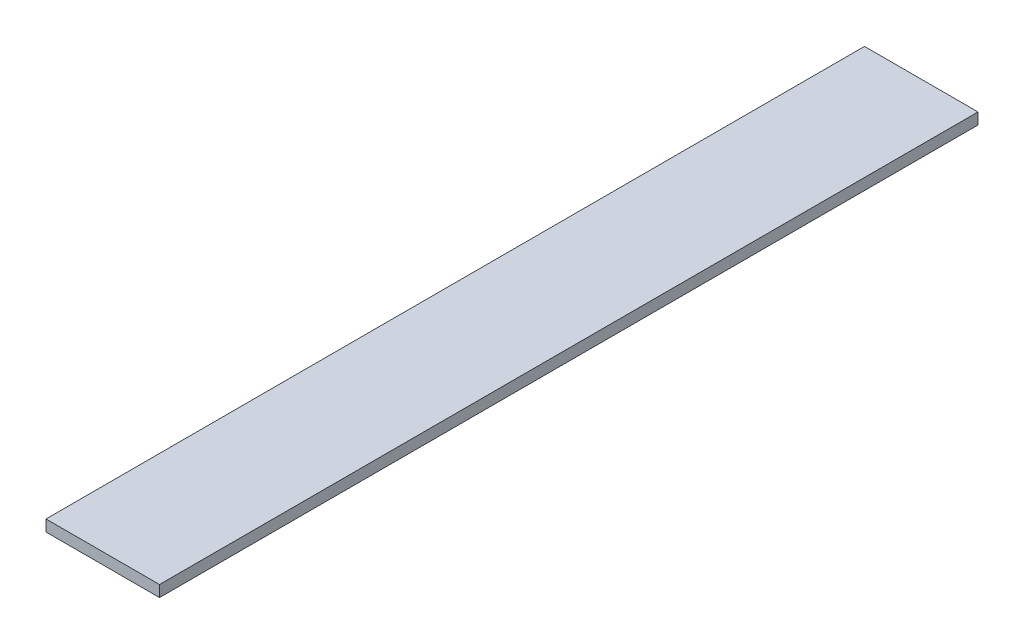
ISO-10303-21;
HEADER;
FILE_DESCRIPTION(('STEP AP214'),'2;1');
FILE_NAME('part.step','',(''),(''),'','','');
FILE_SCHEMA(('AUTOMOTIVE_DESIGN { 1 0 10303 214 1 1 1 1 }'));
ENDSEC;
DATA;
#1=APPLICATION_CONTEXT('core data for automotive mechanical design processes');
#2=APPLICATION_PROTOCOL_DEFINITION('international standard','automotive_design',2000,#1);
#3=PRODUCT_CONTEXT('',#1,'mechanical');
#4=PRODUCT('Part','Part','',(#3));
#5=PRODUCT_RELATED_PRODUCT_CATEGORY('part','',(#4));
#6=PRODUCT_DEFINITION_FORMATION('','',#4);
#7=PRODUCT_DEFINITION_CONTEXT('part definition',#1,'design');
#8=PRODUCT_DEFINITION('design','',#6,#7);
#9=PRODUCT_DEFINITION_SHAPE('','',#8);
#10=(LENGTH_UNIT() NAMED_UNIT(*) SI_UNIT(.MILLI.,.METRE.));
#11=(NAMED_UNIT(*) PLANE_ANGLE_UNIT() SI_UNIT($,.RADIAN.));
#12=(NAMED_UNIT(*) SI_UNIT($,.STERADIAN.) SOLID_ANGLE_UNIT());
#13=UNCERTAINTY_MEASURE_WITH_UNIT(LENGTH_MEASURE(1.E-05),#10,'distance_accuracy_value','');
#14=(GEOMETRIC_REPRESENTATION_CONTEXT(3) GLOBAL_UNCERTAINTY_ASSIGNED_CONTEXT((#13)) GLOBAL_UNIT_ASSIGNED_CONTEXT((#10,
#11,#12)) REPRESENTATION_CONTEXT('',''));
#15=CARTESIAN_POINT('',(0.,0.,0.));
#16=DIRECTION('',(0.,0.,1.));
#17=DIRECTION('',(1.,0.,0.));
#18=AXIS2_PLACEMENT_3D('',#15,#16,#17);
#19=CARTESIAN_POINT('',(0.,0.,343.95));
#20=DIRECTION('',(1.,0.,0.));
#21=DIRECTION('',(0.,0.,-1.));
#22=AXIS2_PLACEMENT_3D('',#19,#20,#21);
#23=PLANE('',#22);
#24=DIRECTION('',(0.,-1.,0.));
#25=VECTOR('',#24,1.);
#26=CARTESIAN_POINT('',(0.,0.,0.));
#27=LINE('',#26,#25);
#28=CARTESIAN_POINT('',(0.,4.7625,0.));
#29=VERTEX_POINT('',#28);
#30=CARTESIAN_POINT('',(0.,0.,0.));
#31=VERTEX_POINT('',#30);
#32=EDGE_CURVE('E100',#29,#31,#27,.T.);
#33=ORIENTED_EDGE('',*,*,#32,.T.);
#34=DIRECTION('',(0.,0.,-1.));
#35=VECTOR('',#34,1.);
#36=CARTESIAN_POINT('',(0.,0.,343.95));
#37=LINE('',#36,#35);
#38=CARTESIAN_POINT('',(0.,0.,343.95));
#39=VERTEX_POINT('',#38);
#40=EDGE_CURVE('E11',#39,#31,#37,.T.);
#41=ORIENTED_EDGE('',*,*,#40,.F.);
#42=DIRECTION('',(0.,-1.,0.));
#43=VECTOR('',#42,1.);
#44=CARTESIAN_POINT('',(0.,0.,343.95));
#45=LINE('',#44,#43);
#46=CARTESIAN_POINT('',(0.,4.7625,343.95));
#47=VERTEX_POINT('',#46);
#48=EDGE_CURVE('E88',#47,#39,#45,.T.);
#49=ORIENTED_EDGE('',*,*,#48,.F.);
#50=DIRECTION('',(0.,0.,-1.));
#51=VECTOR('',#50,1.);
#52=CARTESIAN_POINT('',(0.,4.7625,343.95));
#53=LINE('',#52,#51);
#54=EDGE_CURVE('E96',#47,#29,#53,.T.);
#55=ORIENTED_EDGE('',*,*,#54,.T.);
#56=EDGE_LOOP('',(#33,#41,#49,#55));
#57=FACE_BOUND('',#56,.T.);
#58=ADVANCED_FACE('F37',(#57),#23,.F.);
#59=CARTESIAN_POINT('',(0.,0.,343.95));
#60=DIRECTION('',(0.,1.,0.));
#61=DIRECTION('',(0.,0.,1.));
#62=AXIS2_PLACEMENT_3D('',#59,#60,#61);
#63=PLANE('',#62);
#64=DIRECTION('',(1.,0.,0.));
#65=VECTOR('',#64,1.);
#66=CARTESIAN_POINT('',(0.,0.,0.));
#67=LINE('',#66,#65);
#68=CARTESIAN_POINT('',(47.7,0.,0.));
#69=VERTEX_POINT('',#68);
#70=EDGE_CURVE('E92',#31,#69,#67,.T.);
#71=ORIENTED_EDGE('',*,*,#70,.T.);
#72=DIRECTION('',(0.,0.,-1.));
#73=VECTOR('',#72,1.);
#74=CARTESIAN_POINT('',(47.7,0.,343.95));
#75=LINE('',#74,#73);
#76=CARTESIAN_POINT('',(47.7,0.,343.95));
#77=VERTEX_POINT('',#76);
#78=EDGE_CURVE('E45',#77,#69,#75,.T.);
#79=ORIENTED_EDGE('',*,*,#78,.F.);
#80=DIRECTION('',(1.,0.,0.));
#81=VECTOR('',#80,1.);
#82=CARTESIAN_POINT('',(0.,0.,343.95));
#83=LINE('',#82,#81);
#84=EDGE_CURVE('E83',#39,#77,#83,.T.);
#85=ORIENTED_EDGE('',*,*,#84,.F.);
#86=ORIENTED_EDGE('',*,*,#40,.T.);
#87=EDGE_LOOP('',(#71,#79,#85,#86));
#88=FACE_BOUND('',#87,.T.);
#89=ADVANCED_FACE('F91',(#88),#63,.F.);
#90=CARTESIAN_POINT('',(47.7,0.,343.95));
#91=DIRECTION('',(-1.,0.,0.));
#92=DIRECTION('',(0.,0.,1.));
#93=AXIS2_PLACEMENT_3D('',#90,#91,#92);
#94=PLANE('',#93);
#95=DIRECTION('',(0.,1.,0.));
#96=VECTOR('',#95,1.);
#97=CARTESIAN_POINT('',(47.7,0.,0.));
#98=LINE('',#97,#96);
#99=CARTESIAN_POINT('',(47.7,4.7625,0.));
#100=VERTEX_POINT('',#99);
#101=EDGE_CURVE('E70',#69,#100,#98,.T.);
#102=ORIENTED_EDGE('',*,*,#101,.T.);
#103=DIRECTION('',(0.,0.,-1.));
#104=VECTOR('',#103,1.);
#105=CARTESIAN_POINT('',(47.7,4.7625,343.95));
#106=LINE('',#105,#104);
#107=CARTESIAN_POINT('',(47.7,4.7625,343.95));
#108=VERTEX_POINT('',#107);
#109=EDGE_CURVE('E93',#108,#100,#106,.T.);
#110=ORIENTED_EDGE('',*,*,#109,.F.);
#111=DIRECTION('',(0.,1.,0.));
#112=VECTOR('',#111,1.);
#113=CARTESIAN_POINT('',(47.7,0.,343.95));
#114=LINE('',#113,#112);
#115=EDGE_CURVE('E86',#77,#108,#114,.T.);
#116=ORIENTED_EDGE('',*,*,#115,.F.);
#117=ORIENTED_EDGE('',*,*,#78,.T.);
#118=EDGE_LOOP('',(#102,#110,#116,#117));
#119=FACE_BOUND('',#118,.T.);
#120=ADVANCED_FACE('F94',(#119),#94,.F.);
#121=CARTESIAN_POINT('',(0.,4.7625,343.95));
#122=DIRECTION('',(0.,-1.,0.));
#123=DIRECTION('',(0.,0.,-1.));
#124=AXIS2_PLACEMENT_3D('',#121,#122,#123);
#125=PLANE('',#124);
#126=DIRECTION('',(-1.,0.,0.));
#127=VECTOR('',#126,1.);
#128=CARTESIAN_POINT('',(0.,4.7625,0.));
#129=LINE('',#128,#127);
#130=EDGE_CURVE('E76',#100,#29,#129,.T.);
#131=ORIENTED_EDGE('',*,*,#130,.T.);
#132=ORIENTED_EDGE('',*,*,#54,.F.);
#133=DIRECTION('',(-1.,0.,0.));
#134=VECTOR('',#133,1.);
#135=CARTESIAN_POINT('',(0.,4.7625,343.95));
#136=LINE('',#135,#134);
#137=EDGE_CURVE('E53',#108,#47,#136,.T.);
#138=ORIENTED_EDGE('',*,*,#137,.F.);
#139=ORIENTED_EDGE('',*,*,#109,.T.);
#140=EDGE_LOOP('',(#131,#132,#138,#139));
#141=FACE_BOUND('',#140,.T.);
#142=ADVANCED_FACE('F107',(#141),#125,.F.);
#143=CARTESIAN_POINT('',(0.,0.,343.95));
#144=DIRECTION('',(0.,0.,-1.));
#145=DIRECTION('',(-1.,0.,0.));
#146=AXIS2_PLACEMENT_3D('',#143,#144,#145);
#147=PLANE('',#146);
#148=ORIENTED_EDGE('',*,*,#48,.T.);
#149=ORIENTED_EDGE('',*,*,#84,.T.);
#150=ORIENTED_EDGE('',*,*,#115,.T.);
#151=ORIENTED_EDGE('',*,*,#137,.T.);
#152=EDGE_LOOP('',(#148,#149,#150,#151));
#153=FACE_BOUND('',#152,.T.);
#154=ADVANCED_FACE('F84',(#153),#147,.F.);
#155=CARTESIAN_POINT('',(0.,0.,0.));
#156=DIRECTION('',(0.,0.,-1.));
#157=DIRECTION('',(-1.,0.,0.));
#158=AXIS2_PLACEMENT_3D('',#155,#156,#157);
#159=PLANE('',#158);
#160=ORIENTED_EDGE('',*,*,#32,.F.);
#161=ORIENTED_EDGE('',*,*,#130,.F.);
#162=ORIENTED_EDGE('',*,*,#101,.F.);
#163=ORIENTED_EDGE('',*,*,#70,.F.);
#164=EDGE_LOOP('',(#160,#161,#162,#163));
#165=FACE_BOUND('',#164,.T.);
#166=ADVANCED_FACE('F110',(#165),#159,.T.);
#167=CLOSED_SHELL('',(#58,#89,#120,#142,#154,#166));
#168=MANIFOLD_SOLID_BREP('B2',#167);
#169=ADVANCED_BREP_SHAPE_REPRESENTATION('',(#18,#168),#14);
#170=SHAPE_DEFINITION_REPRESENTATION(#9,#169);
ENDSEC;
END-ISO-10303-21;
